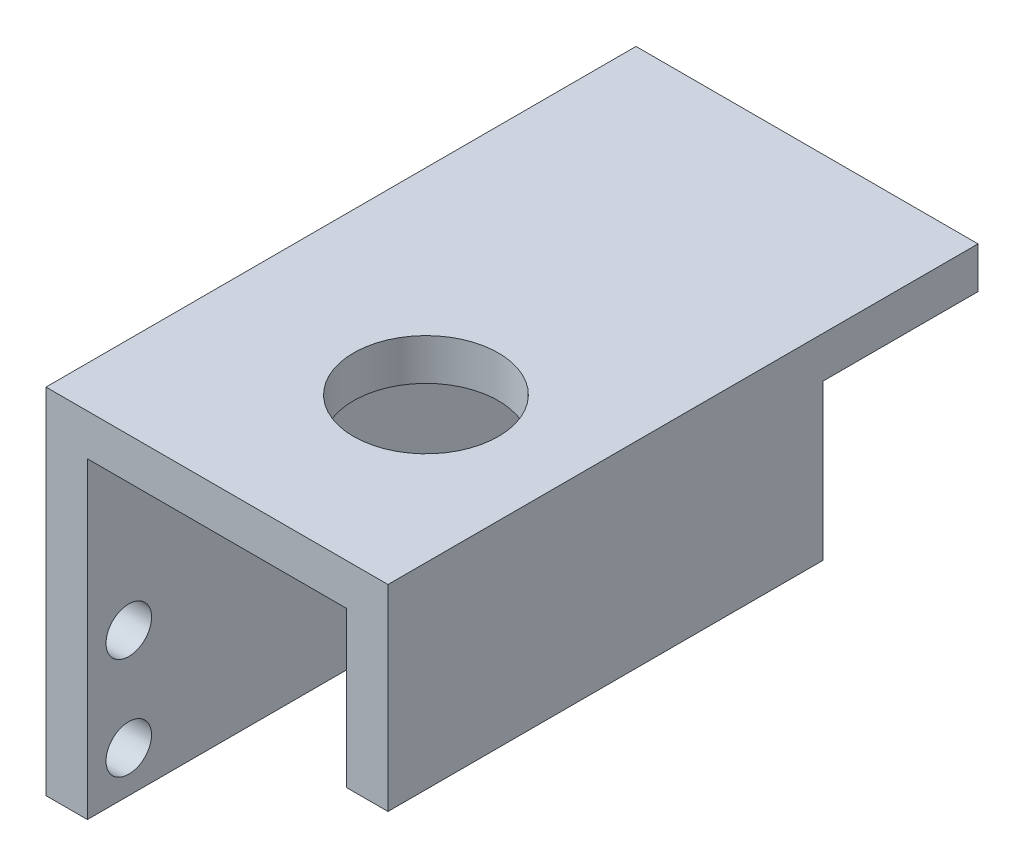
ISO-10303-21;
HEADER;
FILE_DESCRIPTION(('STEP AP214'),'2;1');
FILE_NAME('part.step','',(''),(''),'','','');
FILE_SCHEMA(('AUTOMOTIVE_DESIGN { 1 0 10303 214 1 1 1 1 }'));
ENDSEC;
DATA;
#1=APPLICATION_CONTEXT('core data for automotive mechanical design processes');
#2=APPLICATION_PROTOCOL_DEFINITION('international standard','automotive_design',2000,#1);
#3=PRODUCT_CONTEXT('',#1,'mechanical');
#4=PRODUCT('Part','Part','',(#3));
#5=PRODUCT_RELATED_PRODUCT_CATEGORY('part','',(#4));
#6=PRODUCT_DEFINITION_FORMATION('','',#4);
#7=PRODUCT_DEFINITION_CONTEXT('part definition',#1,'design');
#8=PRODUCT_DEFINITION('design','',#6,#7);
#9=PRODUCT_DEFINITION_SHAPE('','',#8);
#10=(LENGTH_UNIT() NAMED_UNIT(*) SI_UNIT(.MILLI.,.METRE.));
#11=(NAMED_UNIT(*) PLANE_ANGLE_UNIT() SI_UNIT($,.RADIAN.));
#12=(NAMED_UNIT(*) SI_UNIT($,.STERADIAN.) SOLID_ANGLE_UNIT());
#13=UNCERTAINTY_MEASURE_WITH_UNIT(LENGTH_MEASURE(1.E-05),#10,'distance_accuracy_value','');
#14=(GEOMETRIC_REPRESENTATION_CONTEXT(3) GLOBAL_UNCERTAINTY_ASSIGNED_CONTEXT((#13)) GLOBAL_UNIT_ASSIGNED_CONTEXT((#10,
#11,#12)) REPRESENTATION_CONTEXT('',''));
#15=CARTESIAN_POINT('',(0.,0.,0.));
#16=DIRECTION('',(0.,0.,1.));
#17=DIRECTION('',(1.,0.,0.));
#18=AXIS2_PLACEMENT_3D('',#15,#16,#17);
#19=CARTESIAN_POINT('',(33.05,13.1,28.51));
#20=DIRECTION('',(0.,1.,0.));
#21=DIRECTION('',(0.,0.,1.));
#22=AXIS2_PLACEMENT_3D('',#19,#20,#21);
#23=PLANE('',#22);
#24=CARTESIAN_POINT('',(19.,13.1,10.79));
#25=DIRECTION('',(0.,1.,0.));
#26=DIRECTION('',(0.,0.,1.));
#27=AXIS2_PLACEMENT_3D('',#24,#25,#26);
#28=CIRCLE('',#27,7.);
#29=CARTESIAN_POINT('',(19.,13.1,17.79));
#30=VERTEX_POINT('',#29);
#31=EDGE_CURVE('E150',#30,#30,#28,.F.);
#32=ORIENTED_EDGE('',*,*,#31,.F.);
#33=EDGE_LOOP('',(#32));
#34=FACE_BOUND('',#33,.T.);
#35=DIRECTION('',(0.,0.,-1.));
#36=VECTOR('',#35,1.);
#37=CARTESIAN_POINT('',(29.05,13.1,28.51));
#38=LINE('',#37,#36);
#39=CARTESIAN_POINT('',(29.05,13.1,28.51));
#40=VERTEX_POINT('',#39);
#41=CARTESIAN_POINT('',(29.05,13.1,-13.51));
#42=VERTEX_POINT('',#41);
#43=EDGE_CURVE('E147',#40,#42,#38,.T.);
#44=ORIENTED_EDGE('',*,*,#43,.F.);
#45=DIRECTION('',(-1.,0.,0.));
#46=VECTOR('',#45,1.);
#47=CARTESIAN_POINT('',(33.05,13.1,28.51));
#48=LINE('',#47,#46);
#49=CARTESIAN_POINT('',(4.,13.1,28.51));
#50=VERTEX_POINT('',#49);
#51=EDGE_CURVE('E67',#40,#50,#48,.T.);
#52=ORIENTED_EDGE('',*,*,#51,.T.);
#53=DIRECTION('',(0.,0.,-1.));
#54=VECTOR('',#53,1.);
#55=CARTESIAN_POINT('',(4.,13.1,28.51));
#56=LINE('',#55,#54);
#57=CARTESIAN_POINT('',(4.,13.1,-28.51));
#58=VERTEX_POINT('',#57);
#59=EDGE_CURVE('E129',#50,#58,#56,.T.);
#60=ORIENTED_EDGE('',*,*,#59,.T.);
#61=DIRECTION('',(-1.,0.,0.));
#62=VECTOR('',#61,1.);
#63=CARTESIAN_POINT('',(33.05,13.1,-28.51));
#64=LINE('',#63,#62);
#65=CARTESIAN_POINT('',(33.05,13.1,-28.51));
#66=VERTEX_POINT('',#65);
#67=EDGE_CURVE('E174',#66,#58,#64,.T.);
#68=ORIENTED_EDGE('',*,*,#67,.F.);
#69=DIRECTION('',(0.,0.,-1.));
#70=VECTOR('',#69,1.);
#71=CARTESIAN_POINT('',(33.05,13.1,28.51));
#72=LINE('',#71,#70);
#73=CARTESIAN_POINT('',(33.05,13.1,-13.51));
#74=VERTEX_POINT('',#73);
#75=EDGE_CURVE('E128',#74,#66,#72,.T.);
#76=ORIENTED_EDGE('',*,*,#75,.F.);
#77=DIRECTION('',(1.,0.,0.));
#78=VECTOR('',#77,1.);
#79=CARTESIAN_POINT('',(33.05,13.1,-13.51));
#80=LINE('',#79,#78);
#81=EDGE_CURVE('E144',#42,#74,#80,.T.);
#82=ORIENTED_EDGE('',*,*,#81,.F.);
#83=EDGE_LOOP('',(#44,#52,#60,#68,#76,#82));
#84=FACE_BOUND('',#83,.T.);
#85=ADVANCED_FACE('F43',(#34,#84),#23,.F.);
#86=CARTESIAN_POINT('',(4.,0.,0.));
#87=DIRECTION('',(1.,0.,0.));
#88=DIRECTION('',(0.,0.,-1.));
#89=AXIS2_PLACEMENT_3D('',#86,#87,#88);
#90=PLANE('',#89);
#91=ORIENTED_EDGE('',*,*,#59,.F.);
#92=DIRECTION('',(0.,-1.,0.));
#93=VECTOR('',#92,1.);
#94=CARTESIAN_POINT('',(4.,17.1,28.51));
#95=LINE('',#94,#93);
#96=CARTESIAN_POINT('',(4.,-17.1,28.51));
#97=VERTEX_POINT('',#96);
#98=EDGE_CURVE('E218',#50,#97,#95,.T.);
#99=ORIENTED_EDGE('',*,*,#98,.T.);
#100=DIRECTION('',(0.,0.,-1.));
#101=VECTOR('',#100,1.);
#102=CARTESIAN_POINT('',(4.,-17.1,28.51));
#103=LINE('',#102,#101);
#104=CARTESIAN_POINT('',(4.,-17.1,-28.51));
#105=VERTEX_POINT('',#104);
#106=EDGE_CURVE('E222',#97,#105,#103,.T.);
#107=ORIENTED_EDGE('',*,*,#106,.T.);
#108=DIRECTION('',(0.,1.,0.));
#109=VECTOR('',#108,1.);
#110=CARTESIAN_POINT('',(4.,17.1,-28.51));
#111=LINE('',#110,#109);
#112=EDGE_CURVE('E215',#105,#58,#111,.T.);
#113=ORIENTED_EDGE('',*,*,#112,.T.);
#114=EDGE_LOOP('',(#91,#99,#107,#113));
#115=FACE_BOUND('',#114,.T.);
#116=CARTESIAN_POINT('',(4.,-3.25,-24.51));
#117=DIRECTION('',(1.,0.,0.));
#118=DIRECTION('',(0.,0.,-1.));
#119=AXIS2_PLACEMENT_3D('',#116,#117,#118);
#120=CIRCLE('',#119,2.2);
#121=CARTESIAN_POINT('',(4.,-3.25,-26.71));
#122=VERTEX_POINT('',#121);
#123=EDGE_CURVE('E191',#122,#122,#120,.T.);
#124=ORIENTED_EDGE('',*,*,#123,.F.);
#125=EDGE_LOOP('',(#124));
#126=FACE_BOUND('',#125,.T.);
#127=CARTESIAN_POINT('',(4.,-3.25,24.51));
#128=DIRECTION('',(1.,0.,0.));
#129=DIRECTION('',(0.,0.,-1.));
#130=AXIS2_PLACEMENT_3D('',#127,#128,#129);
#131=CIRCLE('',#130,2.2);
#132=CARTESIAN_POINT('',(4.,-3.25,22.31));
#133=VERTEX_POINT('',#132);
#134=EDGE_CURVE('E207',#133,#133,#131,.T.);
#135=ORIENTED_EDGE('',*,*,#134,.F.);
#136=EDGE_LOOP('',(#135));
#137=FACE_BOUND('',#136,.T.);
#138=CARTESIAN_POINT('',(4.,-13.1,24.51));
#139=DIRECTION('',(1.,0.,0.));
#140=DIRECTION('',(0.,0.,-1.));
#141=AXIS2_PLACEMENT_3D('',#138,#139,#140);
#142=CIRCLE('',#141,2.2);
#143=CARTESIAN_POINT('',(4.,-13.1,22.31));
#144=VERTEX_POINT('',#143);
#145=EDGE_CURVE('E199',#144,#144,#142,.T.);
#146=ORIENTED_EDGE('',*,*,#145,.F.);
#147=EDGE_LOOP('',(#146));
#148=FACE_BOUND('',#147,.T.);
#149=CARTESIAN_POINT('',(4.,-13.1,-24.51));
#150=DIRECTION('',(1.,0.,0.));
#151=DIRECTION('',(0.,0.,-1.));
#152=AXIS2_PLACEMENT_3D('',#149,#150,#151);
#153=CIRCLE('',#152,2.2);
#154=CARTESIAN_POINT('',(4.,-13.1,-26.71));
#155=VERTEX_POINT('',#154);
#156=EDGE_CURVE('E183',#155,#155,#153,.T.);
#157=ORIENTED_EDGE('',*,*,#156,.F.);
#158=EDGE_LOOP('',(#157));
#159=FACE_BOUND('',#158,.T.);
#160=ADVANCED_FACE('F261',(#115,#126,#137,#148,#159),#90,.T.);
#161=CARTESIAN_POINT('',(0.,0.,0.));
#162=DIRECTION('',(1.,0.,0.));
#163=DIRECTION('',(0.,0.,-1.));
#164=AXIS2_PLACEMENT_3D('',#161,#162,#163);
#165=PLANE('',#164);
#166=DIRECTION('',(0.,1.,0.));
#167=VECTOR('',#166,1.);
#168=CARTESIAN_POINT('',(0.,17.1,-28.51));
#169=LINE('',#168,#167);
#170=CARTESIAN_POINT('',(0.,-17.1,-28.51));
#171=VERTEX_POINT('',#170);
#172=CARTESIAN_POINT('',(0.,17.1,-28.51));
#173=VERTEX_POINT('',#172);
#174=EDGE_CURVE('E211',#171,#173,#169,.T.);
#175=ORIENTED_EDGE('',*,*,#174,.F.);
#176=DIRECTION('',(0.,0.,-1.));
#177=VECTOR('',#176,1.);
#178=CARTESIAN_POINT('',(0.,-17.1,28.51));
#179=LINE('',#178,#177);
#180=CARTESIAN_POINT('',(0.,-17.1,28.51));
#181=VERTEX_POINT('',#180);
#182=EDGE_CURVE('E219',#181,#171,#179,.T.);
#183=ORIENTED_EDGE('',*,*,#182,.F.);
#184=DIRECTION('',(0.,-1.,0.));
#185=VECTOR('',#184,1.);
#186=CARTESIAN_POINT('',(0.,17.1,28.51));
#187=LINE('',#186,#185);
#188=CARTESIAN_POINT('',(0.,17.1,28.51));
#189=VERTEX_POINT('',#188);
#190=EDGE_CURVE('E232',#189,#181,#187,.T.);
#191=ORIENTED_EDGE('',*,*,#190,.F.);
#192=DIRECTION('',(0.,0.,1.));
#193=VECTOR('',#192,1.);
#194=CARTESIAN_POINT('',(0.,17.1,28.51));
#195=LINE('',#194,#193);
#196=EDGE_CURVE('E229',#173,#189,#195,.T.);
#197=ORIENTED_EDGE('',*,*,#196,.F.);
#198=EDGE_LOOP('',(#175,#183,#191,#197));
#199=FACE_BOUND('',#198,.T.);
#200=CARTESIAN_POINT('',(0.,-3.25,24.51));
#201=DIRECTION('',(1.,0.,0.));
#202=DIRECTION('',(0.,0.,-1.));
#203=AXIS2_PLACEMENT_3D('',#200,#201,#202);
#204=CIRCLE('',#203,2.2);
#205=CARTESIAN_POINT('',(0.,-3.25,22.31));
#206=VERTEX_POINT('',#205);
#207=EDGE_CURVE('E203',#206,#206,#204,.T.);
#208=ORIENTED_EDGE('',*,*,#207,.T.);
#209=EDGE_LOOP('',(#208));
#210=FACE_BOUND('',#209,.T.);
#211=CARTESIAN_POINT('',(0.,-13.1,24.51));
#212=DIRECTION('',(1.,0.,0.));
#213=DIRECTION('',(0.,0.,-1.));
#214=AXIS2_PLACEMENT_3D('',#211,#212,#213);
#215=CIRCLE('',#214,2.2);
#216=CARTESIAN_POINT('',(0.,-13.1,22.31));
#217=VERTEX_POINT('',#216);
#218=EDGE_CURVE('E195',#217,#217,#215,.T.);
#219=ORIENTED_EDGE('',*,*,#218,.T.);
#220=EDGE_LOOP('',(#219));
#221=FACE_BOUND('',#220,.T.);
#222=CARTESIAN_POINT('',(0.,-3.25,-24.51));
#223=DIRECTION('',(1.,0.,0.));
#224=DIRECTION('',(0.,0.,-1.));
#225=AXIS2_PLACEMENT_3D('',#222,#223,#224);
#226=CIRCLE('',#225,2.2);
#227=CARTESIAN_POINT('',(0.,-3.25,-26.71));
#228=VERTEX_POINT('',#227);
#229=EDGE_CURVE('E187',#228,#228,#226,.T.);
#230=ORIENTED_EDGE('',*,*,#229,.T.);
#231=EDGE_LOOP('',(#230));
#232=FACE_BOUND('',#231,.T.);
#233=CARTESIAN_POINT('',(0.,-13.1,-24.51));
#234=DIRECTION('',(1.,0.,0.));
#235=DIRECTION('',(0.,0.,-1.));
#236=AXIS2_PLACEMENT_3D('',#233,#234,#235);
#237=CIRCLE('',#236,2.2);
#238=CARTESIAN_POINT('',(0.,-13.1,-26.71));
#239=VERTEX_POINT('',#238);
#240=EDGE_CURVE('E182',#239,#239,#237,.T.);
#241=ORIENTED_EDGE('',*,*,#240,.T.);
#242=EDGE_LOOP('',(#241));
#243=FACE_BOUND('',#242,.T.);
#244=ADVANCED_FACE('F250',(#199,#210,#221,#232,#243),#165,.F.);
#245=CARTESIAN_POINT('',(4.,17.1,-28.51));
#246=DIRECTION('',(0.,0.,1.));
#247=DIRECTION('',(0.,-1.,0.));
#248=AXIS2_PLACEMENT_3D('',#245,#246,#247);
#249=PLANE('',#248);
#250=ORIENTED_EDGE('',*,*,#174,.T.);
#251=DIRECTION('',(-1.,0.,0.));
#252=VECTOR('',#251,1.);
#253=CARTESIAN_POINT('',(4.,17.1,-28.51));
#254=LINE('',#253,#252);
#255=CARTESIAN_POINT('',(33.05,17.1,-28.51));
#256=VERTEX_POINT('',#255);
#257=EDGE_CURVE('E11',#256,#173,#254,.T.);
#258=ORIENTED_EDGE('',*,*,#257,.F.);
#259=DIRECTION('',(0.,1.,0.));
#260=VECTOR('',#259,1.);
#261=CARTESIAN_POINT('',(33.05,17.1,-28.51));
#262=LINE('',#261,#260);
#263=EDGE_CURVE('E169',#66,#256,#262,.T.);
#264=ORIENTED_EDGE('',*,*,#263,.F.);
#265=ORIENTED_EDGE('',*,*,#67,.T.);
#266=ORIENTED_EDGE('',*,*,#112,.F.);
#267=DIRECTION('',(-1.,0.,0.));
#268=VECTOR('',#267,1.);
#269=CARTESIAN_POINT('',(4.,-17.1,-28.51));
#270=LINE('',#269,#268);
#271=EDGE_CURVE('E225',#105,#171,#270,.T.);
#272=ORIENTED_EDGE('',*,*,#271,.T.);
#273=EDGE_LOOP('',(#250,#258,#264,#265,#266,#272));
#274=FACE_BOUND('',#273,.T.);
#275=ADVANCED_FACE('F45',(#274),#249,.F.);
#276=CARTESIAN_POINT('',(4.,17.1,28.51));
#277=DIRECTION('',(0.,-1.,0.));
#278=DIRECTION('',(0.,0.,-1.));
#279=AXIS2_PLACEMENT_3D('',#276,#277,#278);
#280=PLANE('',#279);
#281=CARTESIAN_POINT('',(19.,17.1,10.79));
#282=DIRECTION('',(0.,1.,0.));
#283=DIRECTION('',(0.,0.,1.));
#284=AXIS2_PLACEMENT_3D('',#281,#282,#283);
#285=CIRCLE('',#284,7.);
#286=CARTESIAN_POINT('',(19.,17.1,17.79));
#287=VERTEX_POINT('',#286);
#288=EDGE_CURVE('E448',#287,#287,#285,.T.);
#289=ORIENTED_EDGE('',*,*,#288,.F.);
#290=EDGE_LOOP('',(#289));
#291=FACE_BOUND('',#290,.T.);
#292=ORIENTED_EDGE('',*,*,#196,.T.);
#293=DIRECTION('',(-1.,0.,0.));
#294=VECTOR('',#293,1.);
#295=CARTESIAN_POINT('',(4.,17.1,28.51));
#296=LINE('',#295,#294);
#297=CARTESIAN_POINT('',(33.05,17.1,28.51));
#298=VERTEX_POINT('',#297);
#299=EDGE_CURVE('E52',#298,#189,#296,.T.);
#300=ORIENTED_EDGE('',*,*,#299,.F.);
#301=DIRECTION('',(0.,0.,1.));
#302=VECTOR('',#301,1.);
#303=CARTESIAN_POINT('',(33.05,17.1,28.51));
#304=LINE('',#303,#302);
#305=EDGE_CURVE('E124',#256,#298,#304,.T.);
#306=ORIENTED_EDGE('',*,*,#305,.F.);
#307=ORIENTED_EDGE('',*,*,#257,.T.);
#308=EDGE_LOOP('',(#292,#300,#306,#307));
#309=FACE_BOUND('',#308,.T.);
#310=ADVANCED_FACE('F266',(#291,#309),#280,.F.);
#311=CARTESIAN_POINT('',(4.,17.1,28.51));
#312=DIRECTION('',(0.,0.,-1.));
#313=DIRECTION('',(0.,1.,0.));
#314=AXIS2_PLACEMENT_3D('',#311,#312,#313);
#315=PLANE('',#314);
#316=ORIENTED_EDGE('',*,*,#190,.T.);
#317=DIRECTION('',(-1.,0.,0.));
#318=VECTOR('',#317,1.);
#319=CARTESIAN_POINT('',(4.,-17.1,28.51));
#320=LINE('',#319,#318);
#321=EDGE_CURVE('E240',#97,#181,#320,.T.);
#322=ORIENTED_EDGE('',*,*,#321,.F.);
#323=ORIENTED_EDGE('',*,*,#98,.F.);
#324=ORIENTED_EDGE('',*,*,#51,.F.);
#325=DIRECTION('',(0.,1.,0.));
#326=VECTOR('',#325,1.);
#327=CARTESIAN_POINT('',(29.05,-1.9,28.51));
#328=LINE('',#327,#326);
#329=CARTESIAN_POINT('',(29.05,-1.9,28.51));
#330=VERTEX_POINT('',#329);
#331=EDGE_CURVE('E134',#330,#40,#328,.T.);
#332=ORIENTED_EDGE('',*,*,#331,.F.);
#333=DIRECTION('',(-1.,0.,0.));
#334=VECTOR('',#333,1.);
#335=CARTESIAN_POINT('',(33.05,-1.9,28.51));
#336=LINE('',#335,#334);
#337=CARTESIAN_POINT('',(33.05,-1.9,28.51));
#338=VERTEX_POINT('',#337);
#339=EDGE_CURVE('E132',#338,#330,#336,.T.);
#340=ORIENTED_EDGE('',*,*,#339,.F.);
#341=DIRECTION('',(0.,-1.,0.));
#342=VECTOR('',#341,1.);
#343=CARTESIAN_POINT('',(33.05,17.1,28.51));
#344=LINE('',#343,#342);
#345=EDGE_CURVE('E117',#298,#338,#344,.T.);
#346=ORIENTED_EDGE('',*,*,#345,.F.);
#347=ORIENTED_EDGE('',*,*,#299,.T.);
#348=EDGE_LOOP('',(#316,#322,#323,#324,#332,#340,#346,#347));
#349=FACE_BOUND('',#348,.T.);
#350=ADVANCED_FACE('F133',(#349),#315,.F.);
#351=CARTESIAN_POINT('',(4.,-17.1,28.51));
#352=DIRECTION('',(0.,1.,0.));
#353=DIRECTION('',(0.,0.,1.));
#354=AXIS2_PLACEMENT_3D('',#351,#352,#353);
#355=PLANE('',#354);
#356=ORIENTED_EDGE('',*,*,#182,.T.);
#357=ORIENTED_EDGE('',*,*,#271,.F.);
#358=ORIENTED_EDGE('',*,*,#106,.F.);
#359=ORIENTED_EDGE('',*,*,#321,.T.);
#360=EDGE_LOOP('',(#356,#357,#358,#359));
#361=FACE_BOUND('',#360,.T.);
#362=ADVANCED_FACE('F254',(#361),#355,.F.);
#363=CARTESIAN_POINT('',(4.,-3.25,24.51));
#364=DIRECTION('',(-1.,0.,0.));
#365=DIRECTION('',(0.,0.,1.));
#366=AXIS2_PLACEMENT_3D('',#363,#364,#365);
#367=CYLINDRICAL_SURFACE('',#366,2.2);
#368=ORIENTED_EDGE('',*,*,#134,.T.);
#369=EDGE_LOOP('',(#368));
#370=FACE_BOUND('',#369,.T.);
#371=ORIENTED_EDGE('',*,*,#207,.F.);
#372=EDGE_LOOP('',(#371));
#373=FACE_BOUND('',#372,.T.);
#374=ADVANCED_FACE('F297',(#370,#373),#367,.F.);
#375=CARTESIAN_POINT('',(4.,-13.1,24.51));
#376=DIRECTION('',(-1.,0.,0.));
#377=DIRECTION('',(0.,0.,1.));
#378=AXIS2_PLACEMENT_3D('',#375,#376,#377);
#379=CYLINDRICAL_SURFACE('',#378,2.2);
#380=ORIENTED_EDGE('',*,*,#145,.T.);
#381=EDGE_LOOP('',(#380));
#382=FACE_BOUND('',#381,.T.);
#383=ORIENTED_EDGE('',*,*,#218,.F.);
#384=EDGE_LOOP('',(#383));
#385=FACE_BOUND('',#384,.T.);
#386=ADVANCED_FACE('F293',(#382,#385),#379,.F.);
#387=CARTESIAN_POINT('',(4.,-3.25,-24.51));
#388=DIRECTION('',(-1.,0.,0.));
#389=DIRECTION('',(0.,0.,1.));
#390=AXIS2_PLACEMENT_3D('',#387,#388,#389);
#391=CYLINDRICAL_SURFACE('',#390,2.2);
#392=ORIENTED_EDGE('',*,*,#123,.T.);
#393=EDGE_LOOP('',(#392));
#394=FACE_BOUND('',#393,.T.);
#395=ORIENTED_EDGE('',*,*,#229,.F.);
#396=EDGE_LOOP('',(#395));
#397=FACE_BOUND('',#396,.T.);
#398=ADVANCED_FACE('F289',(#394,#397),#391,.F.);
#399=CARTESIAN_POINT('',(4.,-13.1,-24.51));
#400=DIRECTION('',(-1.,0.,0.));
#401=DIRECTION('',(0.,0.,1.));
#402=AXIS2_PLACEMENT_3D('',#399,#400,#401);
#403=CYLINDRICAL_SURFACE('',#402,2.2);
#404=ORIENTED_EDGE('',*,*,#156,.T.);
#405=EDGE_LOOP('',(#404));
#406=FACE_BOUND('',#405,.T.);
#407=ORIENTED_EDGE('',*,*,#240,.F.);
#408=EDGE_LOOP('',(#407));
#409=FACE_BOUND('',#408,.T.);
#410=ADVANCED_FACE('F286',(#406,#409),#403,.F.);
#411=CARTESIAN_POINT('',(33.05,0.,0.));
#412=DIRECTION('',(1.,0.,0.));
#413=DIRECTION('',(0.,0.,-1.));
#414=AXIS2_PLACEMENT_3D('',#411,#412,#413);
#415=PLANE('',#414);
#416=ORIENTED_EDGE('',*,*,#345,.T.);
#417=DIRECTION('',(0.,0.,1.));
#418=VECTOR('',#417,1.);
#419=CARTESIAN_POINT('',(33.05,-1.9,28.51));
#420=LINE('',#419,#418);
#421=CARTESIAN_POINT('',(33.05,-1.9,-13.51));
#422=VERTEX_POINT('',#421);
#423=EDGE_CURVE('E121',#422,#338,#420,.T.);
#424=ORIENTED_EDGE('',*,*,#423,.F.);
#425=DIRECTION('',(0.,1.,0.));
#426=VECTOR('',#425,1.);
#427=CARTESIAN_POINT('',(33.05,-1.9,-13.51));
#428=LINE('',#427,#426);
#429=EDGE_CURVE('E59',#422,#74,#428,.T.);
#430=ORIENTED_EDGE('',*,*,#429,.T.);
#431=ORIENTED_EDGE('',*,*,#75,.T.);
#432=ORIENTED_EDGE('',*,*,#263,.T.);
#433=ORIENTED_EDGE('',*,*,#305,.T.);
#434=EDGE_LOOP('',(#416,#424,#430,#431,#432,#433));
#435=FACE_BOUND('',#434,.T.);
#436=ADVANCED_FACE('F119',(#435),#415,.T.);
#437=CARTESIAN_POINT('',(29.05,-1.9,28.51));
#438=DIRECTION('',(1.,0.,0.));
#439=DIRECTION('',(0.,0.,-1.));
#440=AXIS2_PLACEMENT_3D('',#437,#438,#439);
#441=PLANE('',#440);
#442=ORIENTED_EDGE('',*,*,#43,.T.);
#443=DIRECTION('',(0.,1.,0.));
#444=VECTOR('',#443,1.);
#445=CARTESIAN_POINT('',(29.05,-1.9,-13.51));
#446=LINE('',#445,#444);
#447=CARTESIAN_POINT('',(29.05,-1.9,-13.51));
#448=VERTEX_POINT('',#447);
#449=EDGE_CURVE('E161',#448,#42,#446,.T.);
#450=ORIENTED_EDGE('',*,*,#449,.F.);
#451=DIRECTION('',(0.,0.,-1.));
#452=VECTOR('',#451,1.);
#453=CARTESIAN_POINT('',(29.05,-1.9,28.51));
#454=LINE('',#453,#452);
#455=EDGE_CURVE('E138',#330,#448,#454,.T.);
#456=ORIENTED_EDGE('',*,*,#455,.F.);
#457=ORIENTED_EDGE('',*,*,#331,.T.);
#458=EDGE_LOOP('',(#442,#450,#456,#457));
#459=FACE_BOUND('',#458,.T.);
#460=ADVANCED_FACE('F333',(#459),#441,.F.);
#461=CARTESIAN_POINT('',(33.05,-1.9,-13.51));
#462=DIRECTION('',(0.,0.,1.));
#463=DIRECTION('',(1.,0.,0.));
#464=AXIS2_PLACEMENT_3D('',#461,#462,#463);
#465=PLANE('',#464);
#466=ORIENTED_EDGE('',*,*,#81,.T.);
#467=ORIENTED_EDGE('',*,*,#429,.F.);
#468=DIRECTION('',(1.,0.,0.));
#469=VECTOR('',#468,1.);
#470=CARTESIAN_POINT('',(33.05,-1.9,-13.51));
#471=LINE('',#470,#469);
#472=EDGE_CURVE('E142',#448,#422,#471,.T.);
#473=ORIENTED_EDGE('',*,*,#472,.F.);
#474=ORIENTED_EDGE('',*,*,#449,.T.);
#475=EDGE_LOOP('',(#466,#467,#473,#474));
#476=FACE_BOUND('',#475,.T.);
#477=ADVANCED_FACE('F339',(#476),#465,.F.);
#478=CARTESIAN_POINT('',(0.,-1.9,0.));
#479=DIRECTION('',(0.,1.,0.));
#480=DIRECTION('',(0.,0.,1.));
#481=AXIS2_PLACEMENT_3D('',#478,#479,#480);
#482=PLANE('',#481);
#483=ORIENTED_EDGE('',*,*,#423,.T.);
#484=ORIENTED_EDGE('',*,*,#339,.T.);
#485=ORIENTED_EDGE('',*,*,#455,.T.);
#486=ORIENTED_EDGE('',*,*,#472,.T.);
#487=EDGE_LOOP('',(#483,#484,#485,#486));
#488=FACE_BOUND('',#487,.T.);
#489=ADVANCED_FACE('F140',(#488),#482,.F.);
#490=CARTESIAN_POINT('',(19.,-6.69898987322333,10.79));
#491=DIRECTION('',(0.,1.,0.));
#492=DIRECTION('',(0.,0.,1.));
#493=AXIS2_PLACEMENT_3D('',#490,#491,#492);
#494=CYLINDRICAL_SURFACE('',#493,7.);
#495=ORIENTED_EDGE('',*,*,#31,.T.);
#496=EDGE_LOOP('',(#495));
#497=FACE_BOUND('',#496,.T.);
#498=ORIENTED_EDGE('',*,*,#288,.T.);
#499=EDGE_LOOP('',(#498));
#500=FACE_BOUND('',#499,.T.);
#501=ADVANCED_FACE('F353',(#497,#500),#494,.F.);
#502=CLOSED_SHELL('',(#85,#160,#244,#275,#310,#350,#362,#374,#386,#398,#410,#436,#460,#477,#489,#501));
#503=MANIFOLD_SOLID_BREP('B2',#502);
#504=ADVANCED_BREP_SHAPE_REPRESENTATION('',(#18,#503),#14);
#505=SHAPE_DEFINITION_REPRESENTATION(#9,#504);
ENDSEC;
END-ISO-10303-21;
